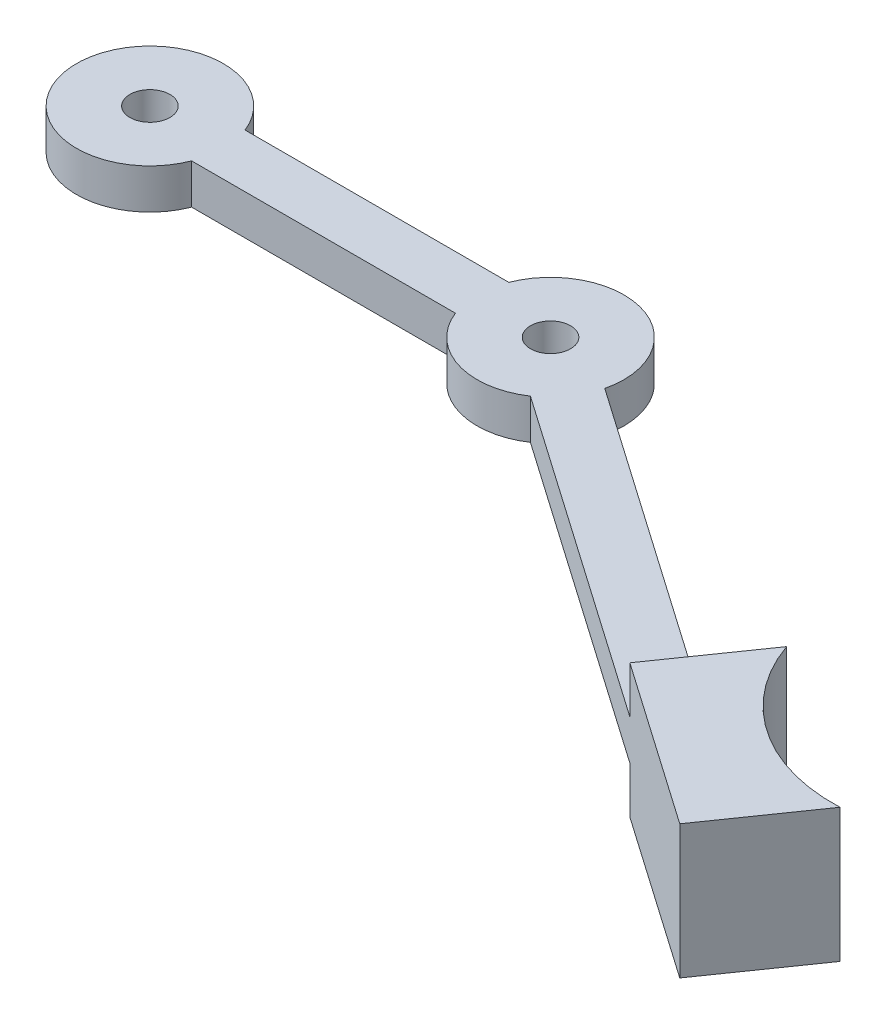
ISO-10303-21;
HEADER;
FILE_DESCRIPTION(('STEP AP214'),'2;1');
FILE_NAME('part.step','',(''),(''),'','','');
FILE_SCHEMA(('AUTOMOTIVE_DESIGN { 1 0 10303 214 1 1 1 1 }'));
ENDSEC;
DATA;
#1=APPLICATION_CONTEXT('core data for automotive mechanical design processes');
#2=APPLICATION_PROTOCOL_DEFINITION('international standard','automotive_design',2000,#1);
#3=PRODUCT_CONTEXT('',#1,'mechanical');
#4=PRODUCT('Part','Part','',(#3));
#5=PRODUCT_RELATED_PRODUCT_CATEGORY('part','',(#4));
#6=PRODUCT_DEFINITION_FORMATION('','',#4);
#7=PRODUCT_DEFINITION_CONTEXT('part definition',#1,'design');
#8=PRODUCT_DEFINITION('design','',#6,#7);
#9=PRODUCT_DEFINITION_SHAPE('','',#8);
#10=(LENGTH_UNIT() NAMED_UNIT(*) SI_UNIT(.MILLI.,.METRE.));
#11=(NAMED_UNIT(*) PLANE_ANGLE_UNIT() SI_UNIT($,.RADIAN.));
#12=(NAMED_UNIT(*) SI_UNIT($,.STERADIAN.) SOLID_ANGLE_UNIT());
#13=UNCERTAINTY_MEASURE_WITH_UNIT(LENGTH_MEASURE(1.E-05),#10,'distance_accuracy_value','');
#14=(GEOMETRIC_REPRESENTATION_CONTEXT(3) GLOBAL_UNCERTAINTY_ASSIGNED_CONTEXT((#13)) GLOBAL_UNIT_ASSIGNED_CONTEXT((#10,
#11,#12)) REPRESENTATION_CONTEXT('',''));
#15=CARTESIAN_POINT('',(0.,0.,0.));
#16=DIRECTION('',(0.,0.,1.));
#17=DIRECTION('',(1.,0.,0.));
#18=AXIS2_PLACEMENT_3D('',#15,#16,#17);
#19=CARTESIAN_POINT('',(0.,-1.5,-2.));
#20=DIRECTION('',(0.,0.,1.));
#21=DIRECTION('',(1.,0.,0.));
#22=AXIS2_PLACEMENT_3D('',#19,#20,#21);
#23=PLANE('',#22);
#24=DIRECTION('',(0.,1.,0.));
#25=VECTOR('',#24,1.);
#26=CARTESIAN_POINT('',(5.1234753829798,-1.5,-2.));
#27=LINE('',#26,#25);
#28=CARTESIAN_POINT('',(5.1234753829798,-1.5,-2.));
#29=VERTEX_POINT('',#28);
#30=CARTESIAN_POINT('',(5.1234753829798,1.5,-2.));
#31=VERTEX_POINT('',#30);
#32=EDGE_CURVE('E222',#29,#31,#27,.T.);
#33=ORIENTED_EDGE('',*,*,#32,.T.);
#34=DIRECTION('',(1.,0.,0.));
#35=VECTOR('',#34,1.);
#36=CARTESIAN_POINT('',(0.,1.5,-2.));
#37=LINE('',#36,#35);
#38=CARTESIAN_POINT('',(24.8765246170202,1.5,-2.));
#39=VERTEX_POINT('',#38);
#40=EDGE_CURVE('E170',#31,#39,#37,.T.);
#41=ORIENTED_EDGE('',*,*,#40,.T.);
#42=DIRECTION('',(0.,1.,0.));
#43=VECTOR('',#42,1.);
#44=CARTESIAN_POINT('',(24.8765246170202,-1.5,-2.));
#45=LINE('',#44,#43);
#46=CARTESIAN_POINT('',(24.8765246170202,-1.5,-2.));
#47=VERTEX_POINT('',#46);
#48=EDGE_CURVE('E11',#47,#39,#45,.T.);
#49=ORIENTED_EDGE('',*,*,#48,.F.);
#50=DIRECTION('',(1.,0.,0.));
#51=VECTOR('',#50,1.);
#52=CARTESIAN_POINT('',(0.,-1.5,-2.));
#53=LINE('',#52,#51);
#54=EDGE_CURVE('E51',#29,#47,#53,.T.);
#55=ORIENTED_EDGE('',*,*,#54,.F.);
#56=EDGE_LOOP('',(#33,#41,#49,#55));
#57=FACE_BOUND('',#56,.T.);
#58=ADVANCED_FACE('F35',(#57),#23,.F.);
#59=CARTESIAN_POINT('',(30.,-1.5,0.));
#60=DIRECTION('',(0.,1.,0.));
#61=DIRECTION('',(0.,0.,1.));
#62=AXIS2_PLACEMENT_3D('',#59,#60,#61);
#63=CYLINDRICAL_SURFACE('',#62,5.5);
#64=ORIENTED_EDGE('',*,*,#48,.T.);
#65=CARTESIAN_POINT('',(30.,1.5,0.));
#66=DIRECTION('',(0.,1.,0.));
#67=DIRECTION('',(0.,0.,1.));
#68=AXIS2_PLACEMENT_3D('',#65,#66,#67);
#69=CIRCLE('',#68,5.5);
#70=CARTESIAN_POINT('',(35.3474464722175,1.5,1.28639660554901));
#71=VERTEX_POINT('',#70);
#72=EDGE_CURVE('E193',#71,#39,#69,.T.);
#73=ORIENTED_EDGE('',*,*,#72,.F.);
#74=DIRECTION('',(0.,1.,0.));
#75=VECTOR('',#74,1.);
#76=CARTESIAN_POINT('',(35.3474464722175,-1.5,1.28639660554901));
#77=LINE('',#76,#75);
#78=CARTESIAN_POINT('',(35.3474464722175,-1.5,1.28639660554901));
#79=VERTEX_POINT('',#78);
#80=EDGE_CURVE('E43',#79,#71,#77,.T.);
#81=ORIENTED_EDGE('',*,*,#80,.F.);
#82=CARTESIAN_POINT('',(30.,-1.5,0.));
#83=DIRECTION('',(0.,1.,0.));
#84=DIRECTION('',(0.,0.,1.));
#85=AXIS2_PLACEMENT_3D('',#82,#83,#84);
#86=CIRCLE('',#85,5.5);
#87=EDGE_CURVE('E259',#79,#47,#86,.T.);
#88=ORIENTED_EDGE('',*,*,#87,.T.);
#89=EDGE_LOOP('',(#64,#73,#81,#88));
#90=FACE_BOUND('',#89,.T.);
#91=ADVANCED_FACE('F283',(#90),#63,.T.);
#92=CARTESIAN_POINT('',(10.9387755102041,-1.5,-15.7096202986958));
#93=DIRECTION('',(-0.571428571428572,0.,0.82065180664829));
#94=DIRECTION('',(0.82065180664829,0.,0.571428571428572));
#95=AXIS2_PLACEMENT_3D('',#92,#93,#94);
#96=PLANE('',#95);
#97=ORIENTED_EDGE('',*,*,#80,.T.);
#98=DIRECTION('',(0.82065180664829,0.,0.571428571428571));
#99=VECTOR('',#98,1.);
#100=CARTESIAN_POINT('',(10.9387755102041,1.5,-15.7096202986958));
#101=LINE('',#100,#99);
#102=CARTESIAN_POINT('',(59.8656703755473,1.5,18.3586963867034));
#103=VERTEX_POINT('',#102);
#104=EDGE_CURVE('E190',#71,#103,#101,.T.);
#105=ORIENTED_EDGE('',*,*,#104,.T.);
#106=DIRECTION('',(0.,1.,0.));
#107=VECTOR('',#106,1.);
#108=CARTESIAN_POINT('',(59.8656703755473,-1.5,18.3586963867034));
#109=LINE('',#108,#107);
#110=CARTESIAN_POINT('',(59.8656703755473,-1.5,18.3586963867034));
#111=VERTEX_POINT('',#110);
#112=EDGE_CURVE('E238',#111,#103,#109,.T.);
#113=ORIENTED_EDGE('',*,*,#112,.F.);
#114=DIRECTION('',(0.82065180664829,0.,0.571428571428571));
#115=VECTOR('',#114,1.);
#116=CARTESIAN_POINT('',(10.9387755102041,-1.5,-15.7096202986958));
#117=LINE('',#116,#115);
#118=EDGE_CURVE('E215',#79,#111,#117,.T.);
#119=ORIENTED_EDGE('',*,*,#118,.F.);
#120=EDGE_LOOP('',(#97,#105,#113,#119));
#121=FACE_BOUND('',#120,.T.);
#122=ADVANCED_FACE('F262',(#121),#96,.F.);
#123=CARTESIAN_POINT('',(8.6530612244898,-1.5,-12.4270130721027));
#124=DIRECTION('',(-0.571428571428572,0.,0.82065180664829));
#125=DIRECTION('',(0.82065180664829,0.,0.571428571428572));
#126=AXIS2_PLACEMENT_3D('',#123,#124,#125);
#127=PLANE('',#126);
#128=DIRECTION('',(0.82065180664829,0.,0.571428571428572));
#129=VECTOR('',#128,1.);
#130=CARTESIAN_POINT('',(8.6530612244898,-1.5,-12.4270130721027));
#131=LINE('',#130,#129);
#132=CARTESIAN_POINT('',(33.0617321865033,-1.5,4.56900383214218));
#133=VERTEX_POINT('',#132);
#134=CARTESIAN_POINT('',(57.579956089833,-1.5,21.6413036132966));
#135=VERTEX_POINT('',#134);
#136=EDGE_CURVE('E212',#133,#135,#131,.T.);
#137=ORIENTED_EDGE('',*,*,#136,.T.);
#138=DIRECTION('',(0.,1.,0.));
#139=VECTOR('',#138,1.);
#140=CARTESIAN_POINT('',(57.579956089833,-5.,21.6413036132966));
#141=LINE('',#140,#139);
#142=CARTESIAN_POINT('',(57.579956089833,-5.,21.6413036132966));
#143=VERTEX_POINT('',#142);
#144=EDGE_CURVE('E138',#143,#135,#141,.T.);
#145=ORIENTED_EDGE('',*,*,#144,.F.);
#146=DIRECTION('',(0.820651806648291,0.,0.57142857142857));
#147=VECTOR('',#146,1.);
#148=CARTESIAN_POINT('',(8.65306122448971,-5.,-12.4270130721026));
#149=LINE('',#148,#147);
#150=CARTESIAN_POINT('',(69.8897331895574,-5.,30.2127321847251));
#151=VERTEX_POINT('',#150);
#152=EDGE_CURVE('E163',#143,#151,#149,.T.);
#153=ORIENTED_EDGE('',*,*,#152,.T.);
#154=DIRECTION('',(0.,1.,0.));
#155=VECTOR('',#154,1.);
#156=CARTESIAN_POINT('',(69.8897331895574,-5.,30.2127321847251));
#157=LINE('',#156,#155);
#158=CARTESIAN_POINT('',(69.8897331895574,5.,30.2127321847251));
#159=VERTEX_POINT('',#158);
#160=EDGE_CURVE('E147',#151,#159,#157,.T.);
#161=ORIENTED_EDGE('',*,*,#160,.T.);
#162=DIRECTION('',(0.820651806648291,0.,0.57142857142857));
#163=VECTOR('',#162,1.);
#164=CARTESIAN_POINT('',(8.65306122448971,5.,-12.4270130721026));
#165=LINE('',#164,#163);
#166=CARTESIAN_POINT('',(57.579956089833,5.,21.6413036132966));
#167=VERTEX_POINT('',#166);
#168=EDGE_CURVE('E142',#167,#159,#165,.T.);
#169=ORIENTED_EDGE('',*,*,#168,.F.);
#170=CARTESIAN_POINT('',(57.579956089833,1.5,21.6413036132966));
#171=VERTEX_POINT('',#170);
#172=EDGE_CURVE('E126',#171,#167,#141,.T.);
#173=ORIENTED_EDGE('',*,*,#172,.F.);
#174=DIRECTION('',(0.82065180664829,0.,0.571428571428572));
#175=VECTOR('',#174,1.);
#176=CARTESIAN_POINT('',(8.6530612244898,1.5,-12.4270130721027));
#177=LINE('',#176,#175);
#178=CARTESIAN_POINT('',(33.0617321865033,1.5,4.56900383214218));
#179=VERTEX_POINT('',#178);
#180=EDGE_CURVE('E189',#179,#171,#177,.T.);
#181=ORIENTED_EDGE('',*,*,#180,.F.);
#182=DIRECTION('',(0.,1.,0.));
#183=VECTOR('',#182,1.);
#184=CARTESIAN_POINT('',(33.0617321865033,-1.5,4.56900383214218));
#185=LINE('',#184,#183);
#186=EDGE_CURVE('E235',#133,#179,#185,.T.);
#187=ORIENTED_EDGE('',*,*,#186,.F.);
#188=EDGE_LOOP('',(#137,#145,#153,#161,#169,#173,#181,#187));
#189=FACE_BOUND('',#188,.T.);
#190=ADVANCED_FACE('F144',(#189),#127,.T.);
#191=CARTESIAN_POINT('',(30.,-1.5,0.));
#192=DIRECTION('',(0.,1.,0.));
#193=DIRECTION('',(0.,0.,1.));
#194=AXIS2_PLACEMENT_3D('',#191,#192,#193);
#195=CYLINDRICAL_SURFACE('',#194,5.5);
#196=ORIENTED_EDGE('',*,*,#186,.T.);
#197=CARTESIAN_POINT('',(30.,1.5,0.));
#198=DIRECTION('',(0.,1.,0.));
#199=DIRECTION('',(0.,0.,1.));
#200=AXIS2_PLACEMENT_3D('',#197,#198,#199);
#201=CIRCLE('',#200,5.5);
#202=CARTESIAN_POINT('',(24.8765246170202,1.5,2.));
#203=VERTEX_POINT('',#202);
#204=EDGE_CURVE('E186',#203,#179,#201,.T.);
#205=ORIENTED_EDGE('',*,*,#204,.F.);
#206=DIRECTION('',(0.,1.,0.));
#207=VECTOR('',#206,1.);
#208=CARTESIAN_POINT('',(24.8765246170202,-1.5,2.));
#209=LINE('',#208,#207);
#210=CARTESIAN_POINT('',(24.8765246170202,-1.5,2.));
#211=VERTEX_POINT('',#210);
#212=EDGE_CURVE('E239',#211,#203,#209,.T.);
#213=ORIENTED_EDGE('',*,*,#212,.F.);
#214=CARTESIAN_POINT('',(30.,-1.5,0.));
#215=DIRECTION('',(0.,1.,0.));
#216=DIRECTION('',(0.,0.,1.));
#217=AXIS2_PLACEMENT_3D('',#214,#215,#216);
#218=CIRCLE('',#217,5.5);
#219=EDGE_CURVE('E209',#211,#133,#218,.T.);
#220=ORIENTED_EDGE('',*,*,#219,.T.);
#221=EDGE_LOOP('',(#196,#205,#213,#220));
#222=FACE_BOUND('',#221,.T.);
#223=ADVANCED_FACE('F246',(#222),#195,.T.);
#224=CARTESIAN_POINT('',(0.,-1.5,2.));
#225=DIRECTION('',(0.,0.,1.));
#226=DIRECTION('',(1.,0.,0.));
#227=AXIS2_PLACEMENT_3D('',#224,#225,#226);
#228=PLANE('',#227);
#229=ORIENTED_EDGE('',*,*,#212,.T.);
#230=DIRECTION('',(1.,0.,0.));
#231=VECTOR('',#230,1.);
#232=CARTESIAN_POINT('',(0.,1.5,2.));
#233=LINE('',#232,#231);
#234=CARTESIAN_POINT('',(5.1234753829798,1.5,2.));
#235=VERTEX_POINT('',#234);
#236=EDGE_CURVE('E183',#235,#203,#233,.T.);
#237=ORIENTED_EDGE('',*,*,#236,.F.);
#238=DIRECTION('',(0.,1.,0.));
#239=VECTOR('',#238,1.);
#240=CARTESIAN_POINT('',(5.1234753829798,-1.5,2.));
#241=LINE('',#240,#239);
#242=CARTESIAN_POINT('',(5.1234753829798,-1.5,2.));
#243=VERTEX_POINT('',#242);
#244=EDGE_CURVE('E249',#243,#235,#241,.T.);
#245=ORIENTED_EDGE('',*,*,#244,.F.);
#246=DIRECTION('',(1.,0.,0.));
#247=VECTOR('',#246,1.);
#248=CARTESIAN_POINT('',(0.,-1.5,2.));
#249=LINE('',#248,#247);
#250=EDGE_CURVE('E206',#243,#211,#249,.T.);
#251=ORIENTED_EDGE('',*,*,#250,.T.);
#252=EDGE_LOOP('',(#229,#237,#245,#251));
#253=FACE_BOUND('',#252,.T.);
#254=ADVANCED_FACE('F292',(#253),#228,.T.);
#255=CARTESIAN_POINT('',(30.,-1.5,0.));
#256=DIRECTION('',(0.,1.,0.));
#257=DIRECTION('',(0.,0.,1.));
#258=AXIS2_PLACEMENT_3D('',#255,#256,#257);
#259=CYLINDRICAL_SURFACE('',#258,1.5);
#260=CARTESIAN_POINT('',(30.,-1.5,0.));
#261=DIRECTION('',(0.,1.,0.));
#262=DIRECTION('',(0.,0.,1.));
#263=AXIS2_PLACEMENT_3D('',#260,#261,#262);
#264=CIRCLE('',#263,1.5);
#265=CARTESIAN_POINT('',(30.,-1.5,1.5));
#266=VERTEX_POINT('',#265);
#267=EDGE_CURVE('E257',#266,#266,#264,.T.);
#268=ORIENTED_EDGE('',*,*,#267,.F.);
#269=EDGE_LOOP('',(#268));
#270=FACE_BOUND('',#269,.T.);
#271=CARTESIAN_POINT('',(30.,1.5,0.));
#272=DIRECTION('',(0.,1.,0.));
#273=DIRECTION('',(0.,0.,1.));
#274=AXIS2_PLACEMENT_3D('',#271,#272,#273);
#275=CIRCLE('',#274,1.5);
#276=CARTESIAN_POINT('',(30.,1.5,1.5));
#277=VERTEX_POINT('',#276);
#278=EDGE_CURVE('E196',#277,#277,#275,.T.);
#279=ORIENTED_EDGE('',*,*,#278,.T.);
#280=EDGE_LOOP('',(#279));
#281=FACE_BOUND('',#280,.T.);
#282=ADVANCED_FACE('F294',(#270,#281),#259,.F.);
#283=CARTESIAN_POINT('',(0.,-1.5,0.));
#284=DIRECTION('',(0.,1.,0.));
#285=DIRECTION('',(0.,0.,1.));
#286=AXIS2_PLACEMENT_3D('',#283,#284,#285);
#287=CYLINDRICAL_SURFACE('',#286,5.5);
#288=ORIENTED_EDGE('',*,*,#244,.T.);
#289=CARTESIAN_POINT('',(0.,1.5,0.));
#290=DIRECTION('',(0.,1.,0.));
#291=DIRECTION('',(0.,0.,1.));
#292=AXIS2_PLACEMENT_3D('',#289,#290,#291);
#293=CIRCLE('',#292,5.5);
#294=EDGE_CURVE('E180',#31,#235,#293,.T.);
#295=ORIENTED_EDGE('',*,*,#294,.F.);
#296=ORIENTED_EDGE('',*,*,#32,.F.);
#297=CARTESIAN_POINT('',(0.,-1.5,0.));
#298=DIRECTION('',(0.,1.,0.));
#299=DIRECTION('',(0.,0.,1.));
#300=AXIS2_PLACEMENT_3D('',#297,#298,#299);
#301=CIRCLE('',#300,5.5);
#302=EDGE_CURVE('E203',#29,#243,#301,.T.);
#303=ORIENTED_EDGE('',*,*,#302,.T.);
#304=EDGE_LOOP('',(#288,#295,#296,#303));
#305=FACE_BOUND('',#304,.T.);
#306=ADVANCED_FACE('F291',(#305),#287,.T.);
#307=CARTESIAN_POINT('',(0.,-1.5,0.));
#308=DIRECTION('',(0.,1.,0.));
#309=DIRECTION('',(0.,0.,1.));
#310=AXIS2_PLACEMENT_3D('',#307,#308,#309);
#311=CYLINDRICAL_SURFACE('',#310,1.5);
#312=CARTESIAN_POINT('',(0.,-1.5,0.));
#313=DIRECTION('',(0.,1.,0.));
#314=DIRECTION('',(0.,0.,1.));
#315=AXIS2_PLACEMENT_3D('',#312,#313,#314);
#316=CIRCLE('',#315,1.5);
#317=CARTESIAN_POINT('',(0.,-1.5,1.5));
#318=VERTEX_POINT('',#317);
#319=EDGE_CURVE('E254',#318,#318,#316,.T.);
#320=ORIENTED_EDGE('',*,*,#319,.F.);
#321=EDGE_LOOP('',(#320));
#322=FACE_BOUND('',#321,.T.);
#323=CARTESIAN_POINT('',(0.,1.5,0.));
#324=DIRECTION('',(0.,1.,0.));
#325=DIRECTION('',(0.,0.,1.));
#326=AXIS2_PLACEMENT_3D('',#323,#324,#325);
#327=CIRCLE('',#326,1.5);
#328=CARTESIAN_POINT('',(0.,1.5,1.5));
#329=VERTEX_POINT('',#328);
#330=EDGE_CURVE('E199',#329,#329,#327,.T.);
#331=ORIENTED_EDGE('',*,*,#330,.T.);
#332=EDGE_LOOP('',(#331));
#333=FACE_BOUND('',#332,.T.);
#334=ADVANCED_FACE('F305',(#322,#333),#311,.F.);
#335=CARTESIAN_POINT('',(0.,-1.5,0.));
#336=DIRECTION('',(0.,1.,0.));
#337=DIRECTION('',(0.,0.,1.));
#338=AXIS2_PLACEMENT_3D('',#335,#336,#337);
#339=PLANE('',#338);
#340=ORIENTED_EDGE('',*,*,#54,.T.);
#341=ORIENTED_EDGE('',*,*,#87,.F.);
#342=ORIENTED_EDGE('',*,*,#118,.T.);
#343=DIRECTION('',(-0.57142857142857,0.,0.820651806648291));
#344=VECTOR('',#343,1.);
#345=CARTESIAN_POINT('',(48.9268948653433,-1.5,34.0683166853992));
#346=LINE('',#345,#344);
#347=EDGE_CURVE('E218',#111,#135,#346,.T.);
#348=ORIENTED_EDGE('',*,*,#347,.T.);
#349=ORIENTED_EDGE('',*,*,#136,.F.);
#350=ORIENTED_EDGE('',*,*,#219,.F.);
#351=ORIENTED_EDGE('',*,*,#250,.F.);
#352=ORIENTED_EDGE('',*,*,#302,.F.);
#353=EDGE_LOOP('',(#340,#341,#342,#348,#349,#350,#351,#352));
#354=FACE_BOUND('',#353,.T.);
#355=ORIENTED_EDGE('',*,*,#267,.T.);
#356=EDGE_LOOP('',(#355));
#357=FACE_BOUND('',#356,.T.);
#358=ORIENTED_EDGE('',*,*,#319,.T.);
#359=EDGE_LOOP('',(#358));
#360=FACE_BOUND('',#359,.T.);
#361=ADVANCED_FACE('F242',(#354,#357,#360),#339,.F.);
#362=CARTESIAN_POINT('',(0.,1.5,0.));
#363=DIRECTION('',(0.,1.,0.));
#364=DIRECTION('',(0.,0.,1.));
#365=AXIS2_PLACEMENT_3D('',#362,#363,#364);
#366=PLANE('',#365);
#367=ORIENTED_EDGE('',*,*,#40,.F.);
#368=ORIENTED_EDGE('',*,*,#294,.T.);
#369=ORIENTED_EDGE('',*,*,#236,.T.);
#370=ORIENTED_EDGE('',*,*,#204,.T.);
#371=ORIENTED_EDGE('',*,*,#180,.T.);
#372=DIRECTION('',(-0.57142857142857,0.,0.820651806648291));
#373=VECTOR('',#372,1.);
#374=CARTESIAN_POINT('',(48.9268948653433,1.5,34.0683166853992));
#375=LINE('',#374,#373);
#376=EDGE_CURVE('E134',#103,#171,#375,.T.);
#377=ORIENTED_EDGE('',*,*,#376,.F.);
#378=ORIENTED_EDGE('',*,*,#104,.F.);
#379=ORIENTED_EDGE('',*,*,#72,.T.);
#380=EDGE_LOOP('',(#367,#368,#369,#370,#371,#377,#378,#379));
#381=FACE_BOUND('',#380,.T.);
#382=ORIENTED_EDGE('',*,*,#278,.F.);
#383=EDGE_LOOP('',(#382));
#384=FACE_BOUND('',#383,.T.);
#385=ORIENTED_EDGE('',*,*,#330,.F.);
#386=EDGE_LOOP('',(#385));
#387=FACE_BOUND('',#386,.T.);
#388=ADVANCED_FACE('F231',(#381,#384,#387),#366,.T.);
#389=CARTESIAN_POINT('',(48.9268948653433,-5.,34.0683166853992));
#390=DIRECTION('',(0.820651806648291,0.,0.57142857142857));
#391=DIRECTION('',(0.57142857142857,0.,-0.820651806648291));
#392=AXIS2_PLACEMENT_3D('',#389,#390,#391);
#393=PLANE('',#392);
#394=ORIENTED_EDGE('',*,*,#112,.T.);
#395=ORIENTED_EDGE('',*,*,#376,.T.);
#396=ORIENTED_EDGE('',*,*,#172,.T.);
#397=DIRECTION('',(0.57142857142857,0.,-0.820651806648291));
#398=VECTOR('',#397,1.);
#399=CARTESIAN_POINT('',(48.9268948653433,5.,34.0683166853992));
#400=LINE('',#399,#398);
#401=CARTESIAN_POINT('',(62.3996462149852,5.,14.7195506480872));
#402=VERTEX_POINT('',#401);
#403=EDGE_CURVE('E131',#167,#402,#400,.T.);
#404=ORIENTED_EDGE('',*,*,#403,.T.);
#405=DIRECTION('',(0.,1.,0.));
#406=VECTOR('',#405,1.);
#407=CARTESIAN_POINT('',(62.3996462149852,-5.,14.7195506480872));
#408=LINE('',#407,#406);
#409=CARTESIAN_POINT('',(62.3996462149852,-5.,14.7195506480872));
#410=VERTEX_POINT('',#409);
#411=EDGE_CURVE('E168',#410,#402,#408,.T.);
#412=ORIENTED_EDGE('',*,*,#411,.F.);
#413=DIRECTION('',(0.57142857142857,0.,-0.820651806648291));
#414=VECTOR('',#413,1.);
#415=CARTESIAN_POINT('',(48.9268948653433,-5.,34.0683166853992));
#416=LINE('',#415,#414);
#417=EDGE_CURVE('E160',#143,#410,#416,.T.);
#418=ORIENTED_EDGE('',*,*,#417,.F.);
#419=ORIENTED_EDGE('',*,*,#144,.T.);
#420=ORIENTED_EDGE('',*,*,#347,.F.);
#421=EDGE_LOOP('',(#394,#395,#396,#404,#412,#418,#419,#420));
#422=FACE_BOUND('',#421,.T.);
#423=ADVANCED_FACE('F128',(#422),#393,.F.);
#424=CARTESIAN_POINT('',(74.2719043442703,-5.,10.5803136030215));
#425=DIRECTION('',(0.,1.,0.));
#426=DIRECTION('',(0.,0.,1.));
#427=AXIS2_PLACEMENT_3D('',#424,#425,#426);
#428=CYLINDRICAL_SURFACE('',#427,12.5731378901061);
#429=ORIENTED_EDGE('',*,*,#411,.T.);
#430=CARTESIAN_POINT('',(74.2719043442703,5.,10.5803136030215));
#431=DIRECTION('',(0.,1.,0.));
#432=DIRECTION('',(0.,0.,1.));
#433=AXIS2_PLACEMENT_3D('',#430,#431,#432);
#434=CIRCLE('',#433,12.5731378901061);
#435=CARTESIAN_POINT('',(74.8133055795418,5.,23.1417896749674));
#436=VERTEX_POINT('',#435);
#437=EDGE_CURVE('E155',#402,#436,#434,.T.);
#438=ORIENTED_EDGE('',*,*,#437,.T.);
#439=DIRECTION('',(0.,1.,0.));
#440=VECTOR('',#439,1.);
#441=CARTESIAN_POINT('',(74.8133055795418,-5.,23.1417896749674));
#442=LINE('',#441,#440);
#443=CARTESIAN_POINT('',(74.8133055795418,-5.,23.1417896749674));
#444=VERTEX_POINT('',#443);
#445=EDGE_CURVE('E171',#444,#436,#442,.T.);
#446=ORIENTED_EDGE('',*,*,#445,.F.);
#447=CARTESIAN_POINT('',(74.2719043442703,-5.,10.5803136030215));
#448=DIRECTION('',(0.,1.,0.));
#449=DIRECTION('',(0.,0.,1.));
#450=AXIS2_PLACEMENT_3D('',#447,#448,#449);
#451=CIRCLE('',#450,12.5731378901061);
#452=EDGE_CURVE('E139',#410,#444,#451,.T.);
#453=ORIENTED_EDGE('',*,*,#452,.F.);
#454=EDGE_LOOP('',(#429,#438,#446,#453));
#455=FACE_BOUND('',#454,.T.);
#456=ADVANCED_FACE('F272',(#455),#428,.F.);
#457=CARTESIAN_POINT('',(61.2366719650678,-5.,42.6397452568276));
#458=DIRECTION('',(-0.820651806648292,0.,-0.571428571428568));
#459=DIRECTION('',(-0.571428571428568,0.,0.820651806648292));
#460=AXIS2_PLACEMENT_3D('',#457,#458,#459);
#461=PLANE('',#460);
#462=ORIENTED_EDGE('',*,*,#445,.T.);
#463=DIRECTION('',(-0.571428571428568,0.,0.820651806648292));
#464=VECTOR('',#463,1.);
#465=CARTESIAN_POINT('',(61.2366719650678,5.,42.6397452568276));
#466=LINE('',#465,#464);
#467=EDGE_CURVE('E151',#436,#159,#466,.T.);
#468=ORIENTED_EDGE('',*,*,#467,.T.);
#469=ORIENTED_EDGE('',*,*,#160,.F.);
#470=DIRECTION('',(-0.571428571428568,0.,0.820651806648292));
#471=VECTOR('',#470,1.);
#472=CARTESIAN_POINT('',(61.2366719650678,-5.,42.6397452568276));
#473=LINE('',#472,#471);
#474=EDGE_CURVE('E165',#444,#151,#473,.T.);
#475=ORIENTED_EDGE('',*,*,#474,.F.);
#476=EDGE_LOOP('',(#462,#468,#469,#475));
#477=FACE_BOUND('',#476,.T.);
#478=ADVANCED_FACE('F270',(#477),#461,.F.);
#479=CARTESIAN_POINT('',(0.,-5.,0.));
#480=DIRECTION('',(0.,1.,0.));
#481=DIRECTION('',(0.,0.,1.));
#482=AXIS2_PLACEMENT_3D('',#479,#480,#481);
#483=PLANE('',#482);
#484=ORIENTED_EDGE('',*,*,#417,.T.);
#485=ORIENTED_EDGE('',*,*,#452,.T.);
#486=ORIENTED_EDGE('',*,*,#474,.T.);
#487=ORIENTED_EDGE('',*,*,#152,.F.);
#488=EDGE_LOOP('',(#484,#485,#486,#487));
#489=FACE_BOUND('',#488,.T.);
#490=ADVANCED_FACE('F266',(#489),#483,.F.);
#491=CARTESIAN_POINT('',(0.,5.,0.));
#492=DIRECTION('',(0.,1.,0.));
#493=DIRECTION('',(0.,0.,1.));
#494=AXIS2_PLACEMENT_3D('',#491,#492,#493);
#495=PLANE('',#494);
#496=ORIENTED_EDGE('',*,*,#403,.F.);
#497=ORIENTED_EDGE('',*,*,#168,.T.);
#498=ORIENTED_EDGE('',*,*,#467,.F.);
#499=ORIENTED_EDGE('',*,*,#437,.F.);
#500=EDGE_LOOP('',(#496,#497,#498,#499));
#501=FACE_BOUND('',#500,.T.);
#502=ADVANCED_FACE('F153',(#501),#495,.T.);
#503=CLOSED_SHELL('',(#58,#91,#122,#190,#223,#254,#282,#306,#334,#361,#388,#423,#456,#478,#490,#502));
#504=MANIFOLD_SOLID_BREP('B2',#503);
#505=ADVANCED_BREP_SHAPE_REPRESENTATION('',(#18,#504),#14);
#506=SHAPE_DEFINITION_REPRESENTATION(#9,#505);
ENDSEC;
END-ISO-10303-21;
